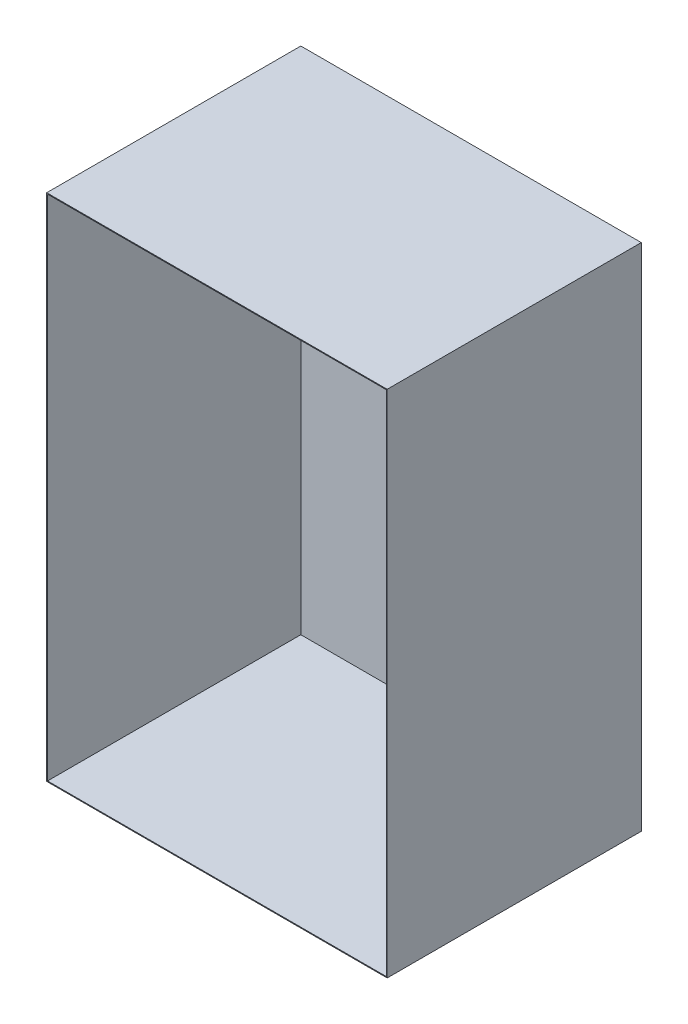
ISO-10303-21;
HEADER;
FILE_DESCRIPTION(('STEP AP214'),'2;1');
FILE_NAME('part.step','',(''),(''),'','','');
FILE_SCHEMA(('AUTOMOTIVE_DESIGN { 1 0 10303 214 1 1 1 1 }'));
ENDSEC;
DATA;
#1=APPLICATION_CONTEXT('core data for automotive mechanical design processes');
#2=APPLICATION_PROTOCOL_DEFINITION('international standard','automotive_design',2000,#1);
#3=PRODUCT_CONTEXT('',#1,'mechanical');
#4=PRODUCT('Part','Part','',(#3));
#5=PRODUCT_RELATED_PRODUCT_CATEGORY('part','',(#4));
#6=PRODUCT_DEFINITION_FORMATION('','',#4);
#7=PRODUCT_DEFINITION_CONTEXT('part definition',#1,'design');
#8=PRODUCT_DEFINITION('design','',#6,#7);
#9=PRODUCT_DEFINITION_SHAPE('','',#8);
#10=(LENGTH_UNIT() NAMED_UNIT(*) SI_UNIT(.MILLI.,.METRE.));
#11=(NAMED_UNIT(*) PLANE_ANGLE_UNIT() SI_UNIT($,.RADIAN.));
#12=(NAMED_UNIT(*) SI_UNIT($,.STERADIAN.) SOLID_ANGLE_UNIT());
#13=UNCERTAINTY_MEASURE_WITH_UNIT(LENGTH_MEASURE(1.E-05),#10,'distance_accuracy_value','');
#14=(GEOMETRIC_REPRESENTATION_CONTEXT(3) GLOBAL_UNCERTAINTY_ASSIGNED_CONTEXT((#13)) GLOBAL_UNIT_ASSIGNED_CONTEXT((#10,
#11,#12)) REPRESENTATION_CONTEXT('',''));
#15=CARTESIAN_POINT('',(0.,0.,0.));
#16=DIRECTION('',(0.,0.,1.));
#17=DIRECTION('',(1.,0.,0.));
#18=AXIS2_PLACEMENT_3D('',#15,#16,#17);
#19=CARTESIAN_POINT('',(0.,0.,299.));
#20=DIRECTION('',(0.,0.,1.));
#21=DIRECTION('',(1.,0.,0.));
#22=AXIS2_PLACEMENT_3D('',#19,#20,#21);
#23=PLANE('',#22);
#24=DIRECTION('',(0.,-1.,0.));
#25=VECTOR('',#24,1.);
#26=CARTESIAN_POINT('',(-201.,301.,299.));
#27=LINE('',#26,#25);
#28=CARTESIAN_POINT('',(-201.,301.,299.));
#29=VERTEX_POINT('',#28);
#30=CARTESIAN_POINT('',(-201.,-301.,299.));
#31=VERTEX_POINT('',#30);
#32=EDGE_CURVE('E151',#29,#31,#27,.T.);
#33=ORIENTED_EDGE('',*,*,#32,.T.);
#34=DIRECTION('',(1.,0.,0.));
#35=VECTOR('',#34,1.);
#36=CARTESIAN_POINT('',(-201.,-301.,299.));
#37=LINE('',#36,#35);
#38=CARTESIAN_POINT('',(201.,-301.,299.));
#39=VERTEX_POINT('',#38);
#40=EDGE_CURVE('E153',#31,#39,#37,.T.);
#41=ORIENTED_EDGE('',*,*,#40,.T.);
#42=DIRECTION('',(0.,1.,0.));
#43=VECTOR('',#42,1.);
#44=CARTESIAN_POINT('',(201.,-301.,299.));
#45=LINE('',#44,#43);
#46=CARTESIAN_POINT('',(201.,301.,299.));
#47=VERTEX_POINT('',#46);
#48=EDGE_CURVE('E155',#39,#47,#45,.T.);
#49=ORIENTED_EDGE('',*,*,#48,.T.);
#50=DIRECTION('',(-1.,0.,0.));
#51=VECTOR('',#50,1.);
#52=CARTESIAN_POINT('',(-201.,301.,299.));
#53=LINE('',#52,#51);
#54=EDGE_CURVE('E55',#47,#29,#53,.T.);
#55=ORIENTED_EDGE('',*,*,#54,.T.);
#56=EDGE_LOOP('',(#33,#41,#49,#55));
#57=FACE_BOUND('',#56,.T.);
#58=DIRECTION('',(1.,0.,0.));
#59=VECTOR('',#58,1.);
#60=CARTESIAN_POINT('',(-200.,-300.,299.));
#61=LINE('',#60,#59);
#62=CARTESIAN_POINT('',(-200.,-300.,299.));
#63=VERTEX_POINT('',#62);
#64=CARTESIAN_POINT('',(200.,-300.,299.));
#65=VERTEX_POINT('',#64);
#66=EDGE_CURVE('E126',#63,#65,#61,.T.);
#67=ORIENTED_EDGE('',*,*,#66,.F.);
#68=DIRECTION('',(0.,-1.,0.));
#69=VECTOR('',#68,1.);
#70=CARTESIAN_POINT('',(-200.,300.,299.));
#71=LINE('',#70,#69);
#72=CARTESIAN_POINT('',(-200.,300.,299.));
#73=VERTEX_POINT('',#72);
#74=EDGE_CURVE('E124',#73,#63,#71,.T.);
#75=ORIENTED_EDGE('',*,*,#74,.F.);
#76=DIRECTION('',(-1.,0.,0.));
#77=VECTOR('',#76,1.);
#78=CARTESIAN_POINT('',(-200.,300.,299.));
#79=LINE('',#78,#77);
#80=CARTESIAN_POINT('',(200.,300.,299.));
#81=VERTEX_POINT('',#80);
#82=EDGE_CURVE('E131',#81,#73,#79,.T.);
#83=ORIENTED_EDGE('',*,*,#82,.F.);
#84=DIRECTION('',(0.,1.,0.));
#85=VECTOR('',#84,1.);
#86=CARTESIAN_POINT('',(200.,-300.,299.));
#87=LINE('',#86,#85);
#88=EDGE_CURVE('E129',#65,#81,#87,.T.);
#89=ORIENTED_EDGE('',*,*,#88,.F.);
#90=EDGE_LOOP('',(#67,#75,#83,#89));
#91=FACE_BOUND('',#90,.T.);
#92=ADVANCED_FACE('F32',(#57,#91),#23,.T.);
#93=CARTESIAN_POINT('',(-201.,301.,299.));
#94=DIRECTION('',(1.,0.,0.));
#95=DIRECTION('',(0.,0.,-1.));
#96=AXIS2_PLACEMENT_3D('',#93,#94,#95);
#97=PLANE('',#96);
#98=DIRECTION('',(0.,0.,-1.));
#99=VECTOR('',#98,1.);
#100=CARTESIAN_POINT('',(-201.,301.,299.));
#101=LINE('',#100,#99);
#102=CARTESIAN_POINT('',(-201.,301.,-1.));
#103=VERTEX_POINT('',#102);
#104=EDGE_CURVE('E104',#29,#103,#101,.T.);
#105=ORIENTED_EDGE('',*,*,#104,.T.);
#106=DIRECTION('',(0.,1.,0.));
#107=VECTOR('',#106,1.);
#108=CARTESIAN_POINT('',(-201.,-301.,-1.));
#109=LINE('',#108,#107);
#110=CARTESIAN_POINT('',(-201.,-301.,-1.));
#111=VERTEX_POINT('',#110);
#112=EDGE_CURVE('E118',#111,#103,#109,.T.);
#113=ORIENTED_EDGE('',*,*,#112,.F.);
#114=DIRECTION('',(0.,0.,-1.));
#115=VECTOR('',#114,1.);
#116=CARTESIAN_POINT('',(-201.,-301.,299.));
#117=LINE('',#116,#115);
#118=EDGE_CURVE('E11',#31,#111,#117,.T.);
#119=ORIENTED_EDGE('',*,*,#118,.F.);
#120=ORIENTED_EDGE('',*,*,#32,.F.);
#121=EDGE_LOOP('',(#105,#113,#119,#120));
#122=FACE_BOUND('',#121,.T.);
#123=ADVANCED_FACE('F34',(#122),#97,.F.);
#124=CARTESIAN_POINT('',(-201.,-301.,299.));
#125=DIRECTION('',(0.,1.,0.));
#126=DIRECTION('',(0.,0.,1.));
#127=AXIS2_PLACEMENT_3D('',#124,#125,#126);
#128=PLANE('',#127);
#129=ORIENTED_EDGE('',*,*,#118,.T.);
#130=DIRECTION('',(-1.,0.,0.));
#131=VECTOR('',#130,1.);
#132=CARTESIAN_POINT('',(201.,-301.,-1.));
#133=LINE('',#132,#131);
#134=CARTESIAN_POINT('',(201.,-301.,-1.));
#135=VERTEX_POINT('',#134);
#136=EDGE_CURVE('E113',#135,#111,#133,.T.);
#137=ORIENTED_EDGE('',*,*,#136,.F.);
#138=DIRECTION('',(0.,0.,-1.));
#139=VECTOR('',#138,1.);
#140=CARTESIAN_POINT('',(201.,-301.,299.));
#141=LINE('',#140,#139);
#142=EDGE_CURVE('E40',#39,#135,#141,.T.);
#143=ORIENTED_EDGE('',*,*,#142,.F.);
#144=ORIENTED_EDGE('',*,*,#40,.F.);
#145=EDGE_LOOP('',(#129,#137,#143,#144));
#146=FACE_BOUND('',#145,.T.);
#147=ADVANCED_FACE('F163',(#146),#128,.F.);
#148=CARTESIAN_POINT('',(201.,-301.,299.));
#149=DIRECTION('',(-1.,0.,0.));
#150=DIRECTION('',(0.,0.,1.));
#151=AXIS2_PLACEMENT_3D('',#148,#149,#150);
#152=PLANE('',#151);
#153=ORIENTED_EDGE('',*,*,#142,.T.);
#154=DIRECTION('',(0.,-1.,0.));
#155=VECTOR('',#154,1.);
#156=CARTESIAN_POINT('',(201.,301.,-1.));
#157=LINE('',#156,#155);
#158=CARTESIAN_POINT('',(201.,301.,-1.));
#159=VERTEX_POINT('',#158);
#160=EDGE_CURVE('E107',#159,#135,#157,.T.);
#161=ORIENTED_EDGE('',*,*,#160,.F.);
#162=DIRECTION('',(0.,0.,-1.));
#163=VECTOR('',#162,1.);
#164=CARTESIAN_POINT('',(201.,301.,299.));
#165=LINE('',#164,#163);
#166=EDGE_CURVE('E97',#47,#159,#165,.T.);
#167=ORIENTED_EDGE('',*,*,#166,.F.);
#168=ORIENTED_EDGE('',*,*,#48,.F.);
#169=EDGE_LOOP('',(#153,#161,#167,#168));
#170=FACE_BOUND('',#169,.T.);
#171=ADVANCED_FACE('F108',(#170),#152,.F.);
#172=CARTESIAN_POINT('',(-201.,301.,299.));
#173=DIRECTION('',(0.,-1.,0.));
#174=DIRECTION('',(0.,0.,-1.));
#175=AXIS2_PLACEMENT_3D('',#172,#173,#174);
#176=PLANE('',#175);
#177=ORIENTED_EDGE('',*,*,#166,.T.);
#178=DIRECTION('',(1.,0.,0.));
#179=VECTOR('',#178,1.);
#180=CARTESIAN_POINT('',(-201.,301.,-1.));
#181=LINE('',#180,#179);
#182=EDGE_CURVE('E101',#103,#159,#181,.T.);
#183=ORIENTED_EDGE('',*,*,#182,.F.);
#184=ORIENTED_EDGE('',*,*,#104,.F.);
#185=ORIENTED_EDGE('',*,*,#54,.F.);
#186=EDGE_LOOP('',(#177,#183,#184,#185));
#187=FACE_BOUND('',#186,.T.);
#188=ADVANCED_FACE('F99',(#187),#176,.F.);
#189=CARTESIAN_POINT('',(-200.,300.,299.));
#190=DIRECTION('',(1.,0.,0.));
#191=DIRECTION('',(0.,0.,-1.));
#192=AXIS2_PLACEMENT_3D('',#189,#190,#191);
#193=PLANE('',#192);
#194=DIRECTION('',(0.,-1.,0.));
#195=VECTOR('',#194,1.);
#196=CARTESIAN_POINT('',(-200.,300.,0.));
#197=LINE('',#196,#195);
#198=CARTESIAN_POINT('',(-200.,300.,0.));
#199=VERTEX_POINT('',#198);
#200=CARTESIAN_POINT('',(-200.,-300.,0.));
#201=VERTEX_POINT('',#200);
#202=EDGE_CURVE('E123',#199,#201,#197,.T.);
#203=ORIENTED_EDGE('',*,*,#202,.F.);
#204=DIRECTION('',(0.,0.,-1.));
#205=VECTOR('',#204,1.);
#206=CARTESIAN_POINT('',(-200.,300.,299.));
#207=LINE('',#206,#205);
#208=EDGE_CURVE('E133',#73,#199,#207,.T.);
#209=ORIENTED_EDGE('',*,*,#208,.F.);
#210=ORIENTED_EDGE('',*,*,#74,.T.);
#211=DIRECTION('',(0.,0.,-1.));
#212=VECTOR('',#211,1.);
#213=CARTESIAN_POINT('',(-200.,-300.,299.));
#214=LINE('',#213,#212);
#215=EDGE_CURVE('E148',#63,#201,#214,.T.);
#216=ORIENTED_EDGE('',*,*,#215,.T.);
#217=EDGE_LOOP('',(#203,#209,#210,#216));
#218=FACE_BOUND('',#217,.T.);
#219=ADVANCED_FACE('F176',(#218),#193,.T.);
#220=CARTESIAN_POINT('',(-200.,-300.,299.));
#221=DIRECTION('',(0.,1.,0.));
#222=DIRECTION('',(0.,0.,1.));
#223=AXIS2_PLACEMENT_3D('',#220,#221,#222);
#224=PLANE('',#223);
#225=DIRECTION('',(1.,0.,0.));
#226=VECTOR('',#225,1.);
#227=CARTESIAN_POINT('',(-200.,-300.,0.));
#228=LINE('',#227,#226);
#229=CARTESIAN_POINT('',(200.,-300.,0.));
#230=VERTEX_POINT('',#229);
#231=EDGE_CURVE('E136',#201,#230,#228,.T.);
#232=ORIENTED_EDGE('',*,*,#231,.F.);
#233=ORIENTED_EDGE('',*,*,#215,.F.);
#234=ORIENTED_EDGE('',*,*,#66,.T.);
#235=DIRECTION('',(0.,0.,-1.));
#236=VECTOR('',#235,1.);
#237=CARTESIAN_POINT('',(200.,-300.,299.));
#238=LINE('',#237,#236);
#239=EDGE_CURVE('E146',#65,#230,#238,.T.);
#240=ORIENTED_EDGE('',*,*,#239,.T.);
#241=EDGE_LOOP('',(#232,#233,#234,#240));
#242=FACE_BOUND('',#241,.T.);
#243=ADVANCED_FACE('F182',(#242),#224,.T.);
#244=CARTESIAN_POINT('',(200.,-300.,299.));
#245=DIRECTION('',(-1.,0.,0.));
#246=DIRECTION('',(0.,0.,1.));
#247=AXIS2_PLACEMENT_3D('',#244,#245,#246);
#248=PLANE('',#247);
#249=DIRECTION('',(0.,1.,0.));
#250=VECTOR('',#249,1.);
#251=CARTESIAN_POINT('',(200.,-300.,0.));
#252=LINE('',#251,#250);
#253=CARTESIAN_POINT('',(200.,300.,0.));
#254=VERTEX_POINT('',#253);
#255=EDGE_CURVE('E139',#230,#254,#252,.T.);
#256=ORIENTED_EDGE('',*,*,#255,.F.);
#257=ORIENTED_EDGE('',*,*,#239,.F.);
#258=ORIENTED_EDGE('',*,*,#88,.T.);
#259=DIRECTION('',(0.,0.,-1.));
#260=VECTOR('',#259,1.);
#261=CARTESIAN_POINT('',(200.,300.,299.));
#262=LINE('',#261,#260);
#263=EDGE_CURVE('E47',#81,#254,#262,.T.);
#264=ORIENTED_EDGE('',*,*,#263,.T.);
#265=EDGE_LOOP('',(#256,#257,#258,#264));
#266=FACE_BOUND('',#265,.T.);
#267=ADVANCED_FACE('F187',(#266),#248,.T.);
#268=CARTESIAN_POINT('',(-200.,300.,299.));
#269=DIRECTION('',(0.,-1.,0.));
#270=DIRECTION('',(0.,0.,-1.));
#271=AXIS2_PLACEMENT_3D('',#268,#269,#270);
#272=PLANE('',#271);
#273=DIRECTION('',(-1.,0.,0.));
#274=VECTOR('',#273,1.);
#275=CARTESIAN_POINT('',(-200.,300.,0.));
#276=LINE('',#275,#274);
#277=EDGE_CURVE('E127',#254,#199,#276,.T.);
#278=ORIENTED_EDGE('',*,*,#277,.F.);
#279=ORIENTED_EDGE('',*,*,#263,.F.);
#280=ORIENTED_EDGE('',*,*,#82,.T.);
#281=ORIENTED_EDGE('',*,*,#208,.T.);
#282=EDGE_LOOP('',(#278,#279,#280,#281));
#283=FACE_BOUND('',#282,.T.);
#284=ADVANCED_FACE('F196',(#283),#272,.T.);
#285=CARTESIAN_POINT('',(0.,0.,0.));
#286=DIRECTION('',(0.,0.,-1.));
#287=DIRECTION('',(-1.,0.,0.));
#288=AXIS2_PLACEMENT_3D('',#285,#286,#287);
#289=PLANE('',#288);
#290=ORIENTED_EDGE('',*,*,#277,.T.);
#291=ORIENTED_EDGE('',*,*,#202,.T.);
#292=ORIENTED_EDGE('',*,*,#231,.T.);
#293=ORIENTED_EDGE('',*,*,#255,.T.);
#294=EDGE_LOOP('',(#290,#291,#292,#293));
#295=FACE_BOUND('',#294,.T.);
#296=ADVANCED_FACE('F194',(#295),#289,.F.);
#297=CARTESIAN_POINT('',(0.,0.,-1.));
#298=DIRECTION('',(0.,0.,-1.));
#299=DIRECTION('',(-1.,0.,0.));
#300=AXIS2_PLACEMENT_3D('',#297,#298,#299);
#301=PLANE('',#300);
#302=ORIENTED_EDGE('',*,*,#182,.T.);
#303=ORIENTED_EDGE('',*,*,#160,.T.);
#304=ORIENTED_EDGE('',*,*,#136,.T.);
#305=ORIENTED_EDGE('',*,*,#112,.T.);
#306=EDGE_LOOP('',(#302,#303,#304,#305));
#307=FACE_BOUND('',#306,.T.);
#308=ADVANCED_FACE('F116',(#307),#301,.T.);
#309=CLOSED_SHELL('',(#92,#123,#147,#171,#188,#219,#243,#267,#284,#296,#308));
#310=MANIFOLD_SOLID_BREP('B2',#309);
#311=ADVANCED_BREP_SHAPE_REPRESENTATION('',(#18,#310),#14);
#312=SHAPE_DEFINITION_REPRESENTATION(#9,#311);
ENDSEC;
END-ISO-10303-21;
